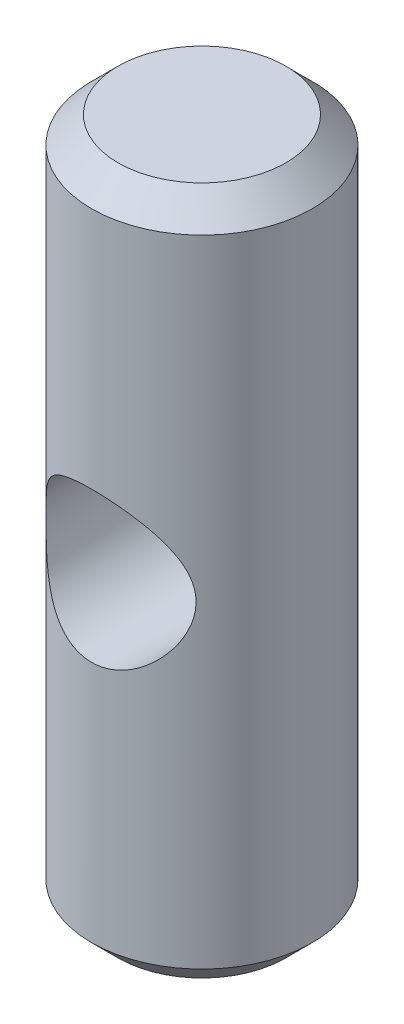
ISO-10303-21;
HEADER;
FILE_DESCRIPTION(('STEP AP214'),'2;1');
FILE_NAME('part.step','',(''),(''),'','','');
FILE_SCHEMA(('AUTOMOTIVE_DESIGN { 1 0 10303 214 1 1 1 1 }'));
ENDSEC;
DATA;
#1=APPLICATION_CONTEXT('core data for automotive mechanical design processes');
#2=APPLICATION_PROTOCOL_DEFINITION('international standard','automotive_design',2000,#1);
#3=PRODUCT_CONTEXT('',#1,'mechanical');
#4=PRODUCT('Part','Part','',(#3));
#5=PRODUCT_RELATED_PRODUCT_CATEGORY('part','',(#4));
#6=PRODUCT_DEFINITION_FORMATION('','',#4);
#7=PRODUCT_DEFINITION_CONTEXT('part definition',#1,'design');
#8=PRODUCT_DEFINITION('design','',#6,#7);
#9=PRODUCT_DEFINITION_SHAPE('','',#8);
#10=(LENGTH_UNIT() NAMED_UNIT(*) SI_UNIT(.MILLI.,.METRE.));
#11=(NAMED_UNIT(*) PLANE_ANGLE_UNIT() SI_UNIT($,.RADIAN.));
#12=(NAMED_UNIT(*) SI_UNIT($,.STERADIAN.) SOLID_ANGLE_UNIT());
#13=UNCERTAINTY_MEASURE_WITH_UNIT(LENGTH_MEASURE(1.E-05),#10,'distance_accuracy_value','');
#14=(GEOMETRIC_REPRESENTATION_CONTEXT(3) GLOBAL_UNCERTAINTY_ASSIGNED_CONTEXT((#13)) GLOBAL_UNIT_ASSIGNED_CONTEXT((#10,
#11,#12)) REPRESENTATION_CONTEXT('',''));
#15=CARTESIAN_POINT('',(0.,0.,0.));
#16=DIRECTION('',(0.,0.,1.));
#17=DIRECTION('',(1.,0.,0.));
#18=AXIS2_PLACEMENT_3D('',#15,#16,#17);
#19=CARTESIAN_POINT('',(0.,39.,0.));
#20=DIRECTION('',(0.,-1.,0.));
#21=DIRECTION('',(0.,0.,-1.));
#22=AXIS2_PLACEMENT_3D('',#19,#20,#21);
#23=CYLINDRICAL_SURFACE('',#22,12.5);
#24=CARTESIAN_POINT('',(0.,8.49999999999999,-12.5));
#25=CARTESIAN_POINT('',(-0.212611229406531,8.4999991639074,-12.4999992129301));
#26=CARTESIAN_POINT('',(-0.425235324985802,8.49201135696874,-12.4945635526216));
#27=CARTESIAN_POINT('',(-0.848748096912115,8.46018514502909,-12.4729546709161));
#28=CARTESIAN_POINT('',(-1.05963663672391,8.43634550481497,-12.4567806127574));
#29=CARTESIAN_POINT('',(-1.47813144874979,8.37316767042175,-12.4140805147799));
#30=CARTESIAN_POINT('',(-1.68573577573117,8.33382062424304,-12.3875485625085));
#31=CARTESIAN_POINT('',(-2.09603319242797,8.24020192526075,-12.3247605864052));
#32=CARTESIAN_POINT('',(-2.29872630768199,8.18593035008375,-12.2885046131505));
#33=CARTESIAN_POINT('',(-2.69687782059281,8.06349857846303,-12.2072897287299));
#34=CARTESIAN_POINT('',(-2.89236813271905,7.99541143656719,-12.1623766550361));
#35=CARTESIAN_POINT('',(-3.27622640483553,7.84594082403003,-12.0646421761312));
#36=CARTESIAN_POINT('',(-3.46459154778753,7.76455216072527,-12.0118176831271));
#37=CARTESIAN_POINT('',(-3.8332134193854,7.58934124360817,-11.8993103261073));
#38=CARTESIAN_POINT('',(-4.01347330451248,7.49552388714581,-11.8396301646949));
#39=CARTESIAN_POINT('',(-4.36534472829234,7.29621057492001,-11.7144651992292));
#40=CARTESIAN_POINT('',(-4.53695302658433,7.19071029003901,-11.6489782452681));
#41=CARTESIAN_POINT('',(-5.06667233733581,6.83873972145517,-11.4338002865402));
#42=CARTESIAN_POINT('',(-5.40791044131654,6.57183587234883,-11.275289082089));
#43=CARTESIAN_POINT('',(-6.04383553620059,5.99230020090767,-10.9476160988973));
#44=CARTESIAN_POINT('',(-6.33845313238221,5.67960152048925,-10.7784389576852));
#45=CARTESIAN_POINT('',(-6.76524031079195,5.15207751469636,-10.5126540168838));
#46=CARTESIAN_POINT('',(-6.91391766961813,4.95081833390408,-10.4152047270699));
#47=CARTESIAN_POINT('',(-7.19372836011809,4.53466127983462,-10.2239406887833));
#48=CARTESIAN_POINT('',(-7.32485747873144,4.31976014953013,-10.1301268169452));
#49=CARTESIAN_POINT('',(-7.56837784801758,3.87728453965254,-9.94950319761834));
#50=CARTESIAN_POINT('',(-7.68079896595188,3.64973104981911,-9.86268240232268));
#51=CARTESIAN_POINT('',(-7.88596866332237,3.1822339365503,-9.69941732082144));
#52=CARTESIAN_POINT('',(-7.9787168962926,2.94229009499671,-9.62297321737187));
#53=CARTESIAN_POINT('',(-8.11849832325081,2.52448279835233,-9.50503456510722));
#54=CARTESIAN_POINT('',(-8.17091788226447,2.34942992045085,-9.45991392681686));
#55=CARTESIAN_POINT('',(-8.26470838093257,1.99455320219839,-9.37808462233733));
#56=CARTESIAN_POINT('',(-8.30608643424036,1.81473251608633,-9.34137054227338));
#57=CARTESIAN_POINT('',(-8.37721986170619,1.45134940351045,-9.27763294927379));
#58=CARTESIAN_POINT('',(-8.40699037275047,1.2677921807992,-9.25059681954442));
#59=CARTESIAN_POINT('',(-8.45450274260778,0.897860127591443,-9.20719421658495));
#60=CARTESIAN_POINT('',(-8.47224456881083,0.711485289457738,-9.19082777228057));
#61=CARTESIAN_POINT('',(-8.49542774911735,0.336415887727055,-9.16940360323845));
#62=CARTESIAN_POINT('',(-8.50080981047673,0.147714490288333,-9.16440039189994));
#63=CARTESIAN_POINT('',(-8.49899309832958,-0.229574503370293,-9.16608517417559));
#64=CARTESIAN_POINT('',(-8.49179431975343,-0.418162099544308,-9.17277317250089));
#65=CARTESIAN_POINT('',(-8.46494901569467,-0.793801379472189,-9.19755223152106));
#66=CARTESIAN_POINT('',(-8.44529473460823,-0.980852032664895,-9.21565039688984));
#67=CARTESIAN_POINT('',(-8.39389136284029,-1.35191704636093,-9.26249376281584));
#68=CARTESIAN_POINT('',(-8.36214199588655,-1.53593133740844,-9.29123920657452));
#69=CARTESIAN_POINT('',(-8.28904286578344,-1.89016540200363,-9.35649660943276));
#70=CARTESIAN_POINT('',(-8.24828955620088,-2.0606000697388,-9.39251749110933));
#71=CARTESIAN_POINT('',(-8.15687607698334,-2.39703838226241,-9.47201379261137));
#72=CARTESIAN_POINT('',(-8.10621222038423,-2.56304035177822,-9.51549198599409));
#73=CARTESIAN_POINT('',(-7.94004717374604,-3.05365736865764,-9.65539110262551));
#74=CARTESIAN_POINT('',(-7.81036608355044,-3.37091404825555,-9.76128254981763));
#75=CARTESIAN_POINT('',(-7.55436370233591,-3.90455677210815,-9.95995741389656));
#76=CARTESIAN_POINT('',(-7.43561726211519,-4.126036099171,-10.0491983821259));
#77=CARTESIAN_POINT('',(-7.18015660851209,-4.55608081630595,-10.2332855426676));
#78=CARTESIAN_POINT('',(-7.04343574552228,-4.7646413848901,-10.3281338022064));
#79=CARTESIAN_POINT('',(-6.75265789244993,-5.16852530921718,-10.5205544166205));
#80=CARTESIAN_POINT('',(-6.59857255721545,-5.36382616273832,-10.6181310241277));
#81=CARTESIAN_POINT('',(-6.2738886822198,-5.74021551780521,-10.8131484907169));
#82=CARTESIAN_POINT('',(-6.10329207879085,-5.9213056813871,-10.9105893643605));
#83=CARTESIAN_POINT('',(-5.744544303175,-6.27003459745641,-11.1036963668884));
#84=CARTESIAN_POINT('',(-5.55625225597372,-6.43754140433822,-11.1993394266261));
#85=CARTESIAN_POINT('',(-5.16396350310388,-6.7562819261896,-11.3855443251041));
#86=CARTESIAN_POINT('',(-4.95996542345107,-6.90751421466188,-11.4761057180928));
#87=CARTESIAN_POINT('',(-4.53740472159614,-7.19212977307888,-11.6496366590009));
#88=CARTESIAN_POINT('',(-4.31886875033325,-7.32554442533666,-11.7326194713579));
#89=CARTESIAN_POINT('',(-3.86797195499051,-7.57330248620781,-11.8888885095943));
#90=CARTESIAN_POINT('',(-3.63561531819139,-7.6876516316151,-11.9621776509134));
#91=CARTESIAN_POINT('',(-3.21144130470796,-7.87259042083719,-12.0819654469364));
#92=CARTESIAN_POINT('',(-3.02205326651099,-7.94726158835923,-12.1308016584786));
#93=CARTESIAN_POINT('',(-2.63670087538949,-8.08328742186423,-12.2203482439586));
#94=CARTESIAN_POINT('',(-2.4407378203019,-8.14464469821701,-12.2610602106394));
#95=CARTESIAN_POINT('',(-2.04341856904867,-8.25329241278791,-12.3334989745208));
#96=CARTESIAN_POINT('',(-1.84206499338533,-8.30058955542913,-12.3652300538139));
#97=CARTESIAN_POINT('',(-1.43518188941921,-8.38052709990867,-12.4190321476114));
#98=CARTESIAN_POINT('',(-1.22965226709327,-8.41316717136181,-12.441102944363));
#99=CARTESIAN_POINT('',(-0.815207190454649,-8.4634009123826,-12.4751277150926));
#100=CARTESIAN_POINT('',(-0.60628256749737,-8.48094279501704,-12.4870468673847));
#101=CARTESIAN_POINT('',(-0.187370529507895,-8.50052106301419,-12.5003522522041));
#102=CARTESIAN_POINT('',(0.022616884653477,-8.50255746107965,-12.5017384933603));
#103=CARTESIAN_POINT('',(0.441977632879455,-8.4910928806054,-12.4939441725854));
#104=CARTESIAN_POINT('',(0.651350937217907,-8.47759116198791,-12.4847631073353));
#105=CARTESIAN_POINT('',(1.06781626073919,-8.43525792222967,-12.4560561283182));
#106=CARTESIAN_POINT('',(1.27490833558745,-8.40642677599957,-12.4365304675482));
#107=CARTESIAN_POINT('',(1.67428781800204,-8.33580620011295,-12.3889073455685));
#108=CARTESIAN_POINT('',(1.86677484519458,-8.29479186339277,-12.3613238997183));
#109=CARTESIAN_POINT('',(2.24721772650369,-8.19990622798388,-12.2978542116027));
#110=CARTESIAN_POINT('',(2.43517201084202,-8.14603054360643,-12.2619651372658));
#111=CARTESIAN_POINT('',(2.80541670195474,-8.02605126266958,-12.1825890609117));
#112=CARTESIAN_POINT('',(2.98770864248847,-7.95995101171516,-12.1391041378977));
#113=CARTESIAN_POINT('',(3.34590416619502,-7.81614954581967,-12.0452988690557));
#114=CARTESIAN_POINT('',(3.52180537622699,-7.73844407503488,-11.9949760162484));
#115=CARTESIAN_POINT('',(3.88031205030355,-7.56544076962023,-11.8840705305856));
#116=CARTESIAN_POINT('',(4.06232426080534,-7.46923194395762,-11.822988789701));
#117=CARTESIAN_POINT('',(4.4174003575195,-7.26488731836293,-11.6949675512413));
#118=CARTESIAN_POINT('',(4.59046042536939,-7.15674648968412,-11.6280255863472));
#119=CARTESIAN_POINT('',(5.09553911437629,-6.81546087342392,-11.4200600711919));
#120=CARTESIAN_POINT('',(5.41350998148694,-6.56542673887321,-11.2718797237288));
#121=CARTESIAN_POINT('',(5.88447632341429,-6.1382424608712,-11.0300157872951));
#122=CARTESIAN_POINT('',(6.05109822364662,-5.97401067710243,-10.9392888561071));
#123=CARTESIAN_POINT('',(6.36999669503495,-5.63272878923321,-10.7567107993367));
#124=CARTESIAN_POINT('',(6.52227604622003,-5.45568118105036,-10.6648598955309));
#125=CARTESIAN_POINT('',(6.81208921698918,-5.08920872094441,-10.4821186841034));
#126=CARTESIAN_POINT('',(6.94961342696887,-4.899775930587,-10.3912290368342));
#127=CARTESIAN_POINT('',(7.2091725737248,-4.50919739117484,-10.212867133094));
#128=CARTESIAN_POINT('',(7.3312099997648,-4.30805353209675,-10.1253943289862));
#129=CARTESIAN_POINT('',(7.6413117174783,-3.74504307831773,-9.89544194142684));
#130=CARTESIAN_POINT('',(7.81365560029483,-3.37172386163585,-9.75870050072534));
#131=CARTESIAN_POINT('',(8.03185839695517,-2.78965723987431,-9.57852897801291));
#132=CARTESIAN_POINT('',(8.09785246373813,-2.5920508777165,-9.5226488006139));
#133=CARTESIAN_POINT('',(8.21569108391976,-2.19002993966036,-9.42117069089607));
#134=CARTESIAN_POINT('',(8.26753853402295,-1.98561676717839,-9.375570653917));
#135=CARTESIAN_POINT('',(8.34891457244464,-1.60530111272045,-9.30312255176955));
#136=CARTESIAN_POINT('',(8.38071060614132,-1.43023273327683,-9.27442445038085));
#137=CARTESIAN_POINT('',(8.43335759447561,-1.07717839228992,-9.22657851080833));
#138=CARTESIAN_POINT('',(8.45421074489629,-0.899193023462812,-9.20742875670543));
#139=CARTESIAN_POINT('',(8.48462590513333,-0.541575160788118,-9.17940927863587));
#140=CARTESIAN_POINT('',(8.49419587547128,-0.361943918418958,-9.17053230708616));
#141=CARTESIAN_POINT('',(8.50190326230583,-0.00221826905570866,-9.1633874625019));
#142=CARTESIAN_POINT('',(8.50004044888092,0.177876147180333,-9.16511980282826));
#143=CARTESIAN_POINT('',(8.48491973775006,0.537055645604595,-9.17911982332172));
#144=CARTESIAN_POINT('',(8.47166896204319,0.716141288232058,-9.19138091883147));
#145=CARTESIAN_POINT('',(8.43401190841614,1.07214121355693,-9.2259466375048));
#146=CARTESIAN_POINT('',(8.40960570874408,1.24905551147598,-9.24825119021997));
#147=CARTESIAN_POINT('',(8.34999087744399,1.5997902732501,-9.30211059217691));
#148=CARTESIAN_POINT('',(8.31477174417639,1.77360755484554,-9.33367443280799));
#149=CARTESIAN_POINT('',(8.23399688640742,2.11718373164181,-9.4050090004596));
#150=CARTESIAN_POINT('',(8.18843529403794,2.28694026227548,-9.44478438519404));
#151=CARTESIAN_POINT('',(8.07133858065295,2.67520382969941,-9.54521836203062));
#152=CARTESIAN_POINT('',(7.99615670437936,2.89194177930875,-9.60848763482576));
#153=CARTESIAN_POINT('',(7.82977778562174,3.31610119313206,-9.74454307136206));
#154=CARTESIAN_POINT('',(7.73857476504883,3.52351914329787,-9.81733278493736));
#155=CARTESIAN_POINT('',(7.54100901203986,3.92861609861968,-9.96989338780853));
#156=CARTESIAN_POINT('',(7.43462915211643,4.12628375644267,-10.0496721246119));
#157=CARTESIAN_POINT('',(7.20756400400657,4.5112031222072,-10.2137476160052));
#158=CARTESIAN_POINT('',(7.08687969143419,4.69845553922644,-10.2980440622568));
#159=CARTESIAN_POINT('',(6.82924274151675,5.06584454227428,-10.4707196427112));
#160=CARTESIAN_POINT('',(6.69201335046604,5.24576434327886,-10.5591466909608));
#161=CARTESIAN_POINT('',(6.40372122532588,5.59405742314174,-10.7364335060975));
#162=CARTESIAN_POINT('',(6.25265324016938,5.76242627624611,-10.8252934250271));
#163=CARTESIAN_POINT('',(5.93711876139708,6.0870234387961,-11.0015125380574));
#164=CARTESIAN_POINT('',(5.7726502369996,6.24324990109033,-11.0888715022582));
#165=CARTESIAN_POINT('',(5.43075906662421,6.54282142578617,-11.2602586816036));
#166=CARTESIAN_POINT('',(5.25333683727211,6.68616690214425,-11.3442870037365));
#167=CARTESIAN_POINT('',(4.86280344788979,6.97635617744865,-11.5175664782057));
#168=CARTESIAN_POINT('',(4.64801393352488,7.12135889779644,-11.6061386832676));
#169=CARTESIAN_POINT('',(4.20346535730457,7.39247293121864,-11.7744368948175));
#170=CARTESIAN_POINT('',(3.97370392709398,7.51858124499235,-11.854161496316));
#171=CARTESIAN_POINT('',(3.50095025371574,7.74999907866129,-12.0022746388593));
#172=CARTESIAN_POINT('',(3.25798165837109,7.85534430590749,-12.0706826085548));
#173=CARTESIAN_POINT('',(2.76031494250426,8.0437156063356,-12.1941088824536));
#174=CARTESIAN_POINT('',(2.50562230406707,8.12675198927162,-12.249133370549));
#175=CARTESIAN_POINT('',(2.06534954894274,8.24739792519654,-12.329567052311));
#176=CARTESIAN_POINT('',(1.882142055752,8.29115225681941,-12.3589009427645));
#177=CARTESIAN_POINT('',(1.51217598659134,8.36653680966856,-12.4095993153829));
#178=CARTESIAN_POINT('',(1.32541809579891,8.39816934579647,-12.4309653191557));
#179=CARTESIAN_POINT('',(0.949520469364734,8.44892697758819,-12.4653126060539));
#180=CARTESIAN_POINT('',(0.760381715142823,8.46805706525246,-12.4782972356842));
#181=CARTESIAN_POINT('',(0.380832179850998,8.49359470711208,-12.495641797779));
#182=CARTESIAN_POINT('',(0.190421250259467,8.5000007488306,-12.5000007049244));
#183=CARTESIAN_POINT('',(0.,8.49999999999999,-12.5));
#184=B_SPLINE_CURVE_WITH_KNOTS('',3,(#24,#25,#26,#27,#28,#29,#30,#31,#32,#33,#34,#35,#36,#37,
#38,#39,#40,#41,#42,#43,#44,#45,#46,#47,#48,#49,#50,#51,#52,#53,#54,#55,#56,#57,#58,#59,#60,#61,
#62,#63,#64,#65,#66,#67,#68,#69,#70,#71,#72,#73,#74,#75,#76,#77,#78,#79,#80,#81,#82,#83,#84,#85,
#86,#87,#88,#89,#90,#91,#92,#93,#94,#95,#96,#97,#98,#99,#100,#101,#102,#103,#104,#105,#106,#107,
#108,#109,#110,#111,#112,#113,#114,#115,#116,#117,#118,#119,#120,#121,#122,#123,#124,#125,#126,
#127,#128,#129,#130,#131,#132,#133,#134,#135,#136,#137,#138,#139,#140,#141,#142,#143,#144,#145,
#146,#147,#148,#149,#150,#151,#152,#153,#154,#155,#156,#157,#158,#159,#160,#161,#162,#163,#164,
#165,#166,#167,#168,#169,#170,#171,#172,#173,#174,#175,#176,#177,#178,#179,#180,#181,#182,#183),
.UNSPECIFIED.,.T.,.F.,(4,2,2,2,2,2,2,2,2,2,2,2,2,2,2,2,2,2,2,2,2,2,2,2,2,2,2,2,2,2,2,2,2,2,2,2,
2,2,2,2,2,2,2,2,2,2,2,2,2,2,2,2,2,2,2,2,2,2,2,2,2,2,2,2,2,2,2,2,2,2,2,2,2,2,2,2,2,2,2,4),(0.,
0.637638569316182,1.27532683079305,1.91337962848085,2.55142910754345,3.18618871327802,
3.82119671172003,4.45595523440742,5.09094975939608,6.46937914241849,7.84984140223582,
8.65461300195751,9.45957746955406,10.2632442217744,11.0669251264715,11.6310837059482,
12.1948779355317,12.7579344669572,13.3209925248329,13.8867461142772,14.4524999316997,
15.0186063707375,15.5847257413799,16.1209085432474,16.6572911988077,17.729962068664,
18.5291174726279,19.3285693591328,20.129345680615,20.9300282058792,21.7377350551794,
22.5455126441933,23.3518481787031,24.1579406479864,24.7853694223414,25.4126750693585,
26.0396811108585,26.6667012849985,27.2958636699022,27.9250255393692,28.554217376946,
29.1833938271328,29.7789366809116,30.3746829041908,30.9702663249758,31.566068695707,
32.2096414263224,32.8534864344468,34.1409914628099,34.893197555009,35.6452575450771,
36.3978043947685,37.1502301304352,38.4443718771902,39.0908409976289,39.7371776455615,
40.2773148354423,40.8173436006944,41.3569911358348,41.8966495237113,42.4359706561683,
42.9752880056927,43.5151308120085,44.0552806709294,44.7681537714426,45.4812934388263,
46.1952443656952,46.909146626585,47.6373057820495,48.3657423918077,49.0942895983837,
49.8228133832457,50.6432675911966,51.463851900488,52.2830124533646,53.1017937876741,
53.673152307973,54.2444016613844,54.8154227857347,55.3865117819358),.UNSPECIFIED.);
#185=CARTESIAN_POINT('',(0.,8.49999999999999,-12.5));
#186=VERTEX_POINT('',#185);
#187=EDGE_CURVE('E43',#186,#186,#184,.T.);
#188=ORIENTED_EDGE('',*,*,#187,.T.);
#189=EDGE_LOOP('',(#188));
#190=FACE_BOUND('',#189,.T.);
#191=CARTESIAN_POINT('',(8.50000000000005,0.,9.16515138991168));
#192=CARTESIAN_POINT('',(8.49999848103357,-0.206088728048728,9.16515435137744));
#193=CARTESIAN_POINT('',(8.49248800048588,-0.412212060655086,9.17213583057472));
#194=CARTESIAN_POINT('',(8.46261532781037,-0.822482695778911,9.19970325006821));
#195=CARTESIAN_POINT('',(8.44024911507193,-1.02662944816777,9.22029287331569));
#196=CARTESIAN_POINT('',(8.38110344428739,-1.43143853036619,9.2740873013755));
#197=CARTESIAN_POINT('',(8.3443018628379,-1.63209501573091,9.30731146727961));
#198=CARTESIAN_POINT('',(8.25695470058672,-2.02827116070187,9.3848869197149));
#199=CARTESIAN_POINT('',(8.20640187372766,-2.22378805232511,9.42924407168694));
#200=CARTESIAN_POINT('',(8.09292937857942,-2.60651269076976,9.52680514030859));
#201=CARTESIAN_POINT('',(8.0301470384164,-2.79378671925094,9.57990988979939));
#202=CARTESIAN_POINT('',(7.89263199756949,-3.16147211352697,9.69352020888648));
#203=CARTESIAN_POINT('',(7.81790087738241,-3.34188438304345,9.75402479943771));
#204=CARTESIAN_POINT('',(7.5766884397089,-3.87228632386062,9.94412008782077));
#205=CARTESIAN_POINT('',(7.39312795371836,-4.21164033238044,10.0823463734539));
#206=CARTESIAN_POINT('',(7.07025089931892,-4.72346898058288,10.3093525360843));
#207=CARTESIAN_POINT('',(6.94452130536774,-4.90639680333774,10.3946444109643));
#208=CARTESIAN_POINT('',(6.67951741016979,-5.26147264248069,10.5668815131737));
#209=CARTESIAN_POINT('',(6.54024093789125,-5.43361892372064,10.6538270037107));
#210=CARTESIAN_POINT('',(6.24847211705665,-5.76677475148639,10.8275327870459));
#211=CARTESIAN_POINT('',(6.09596586520742,-5.92777225428573,10.9142927843839));
#212=CARTESIAN_POINT('',(5.77824797680767,-6.23787798047958,11.0857764344671));
#213=CARTESIAN_POINT('',(5.61303651934252,-6.38698637139595,11.1705001158931));
#214=CARTESIAN_POINT('',(5.24396777814779,-6.69455134158238,11.3489649684113));
#215=CARTESIAN_POINT('',(5.03807127007634,-6.85092906699647,11.4420938236212));
#216=CARTESIAN_POINT('',(4.61060952227589,-7.14560475266038,11.6209276386171));
#217=CARTESIAN_POINT('',(4.38904162928077,-7.28389964002449,11.7066313357849));
#218=CARTESIAN_POINT('',(3.93167037859809,-7.54059872775554,11.86805321834));
#219=CARTESIAN_POINT('',(3.695889152668,-7.65903281886523,11.9437863719154));
#220=CARTESIAN_POINT('',(3.21133572211429,-7.87448721302272,12.0830786875566));
#221=CARTESIAN_POINT('',(2.9625687953924,-7.97151613345684,12.1466427473417));
#222=CARTESIAN_POINT('',(2.5194083510416,-8.12048949225862,12.2450026092391));
#223=CARTESIAN_POINT('',(2.32744758813448,-8.17761353995429,12.2829947849229));
#224=CARTESIAN_POINT('',(1.93855933051285,-8.27842440905486,12.3503400478085));
#225=CARTESIAN_POINT('',(1.74163284484193,-8.32211393694642,12.3796948750187));
#226=CARTESIAN_POINT('',(1.34415899673731,-8.3954782559937,12.4291319561483));
#227=CARTESIAN_POINT('',(1.14361390688545,-8.42516154578202,12.4492198328542));
#228=CARTESIAN_POINT('',(0.740172438537721,-8.47014398577308,12.4797061168245));
#229=CARTESIAN_POINT('',(0.537275982330216,-8.48544265919027,12.4901042029156));
#230=CARTESIAN_POINT('',(0.130292677784343,-8.5014449957978,12.5009812517458));
#231=CARTESIAN_POINT('',(-0.0737956130943147,-8.50212364913509,12.5014432171794));
#232=CARTESIAN_POINT('',(-0.481268456170092,-8.48881228385605,12.4923941008278));
#233=CARTESIAN_POINT('',(-0.684653010975125,-8.47482231965741,12.4828830560406));
#234=CARTESIAN_POINT('',(-1.08925251926921,-8.43237316575785,12.4541027119486));
#235=CARTESIAN_POINT('',(-1.290466933798,-8.40391046253482,12.4348310430782));
#236=CARTESIAN_POINT('',(-1.6892604092624,-8.33291196470859,12.3869582752026));
#237=CARTESIAN_POINT('',(-1.88683945822211,-8.29037612375329,12.3583571454694));
#238=CARTESIAN_POINT('',(-2.273411257514,-8.19271606831162,12.2930591969054));
#239=CARTESIAN_POINT('',(-2.46249567210529,-8.13784446889487,12.2565252803728));
#240=CARTESIAN_POINT('',(-2.83498515320645,-8.01569065240002,12.1757627196494));
#241=CARTESIAN_POINT('',(-3.01838819594673,-7.94840407100622,12.1315313698437));
#242=CARTESIAN_POINT('',(-3.37855314009493,-7.80212422338482,12.0361979722602));
#243=CARTESIAN_POINT('',(-3.55531685315279,-7.72313418015831,11.9850978164322));
#244=CARTESIAN_POINT('',(-3.90160552151592,-7.55411389413236,11.8768867769885));
#245=CARTESIAN_POINT('',(-4.07112783111469,-7.46407966198258,11.8197737224727));
#246=CARTESIAN_POINT('',(-4.60515263764886,-7.15702515533225,11.6273640591456));
#247=CARTESIAN_POINT('',(-4.95443467378749,-6.91941946360898,11.4819087248686));
#248=CARTESIAN_POINT('',(-5.61048966004963,-6.39907800227539,11.1760341307865));
#249=CARTESIAN_POINT('',(-5.91721289759737,-6.11629027143204,11.0155977314986));
#250=CARTESIAN_POINT('',(-6.36728205780269,-5.63619465118879,10.7584574722756));
#251=CARTESIAN_POINT('',(-6.5256230542975,-5.45208481303526,10.6629213780352));
#252=CARTESIAN_POINT('',(-6.82630605473485,-5.07055692129289,10.4729720040763));
#253=CARTESIAN_POINT('',(-6.96864485838237,-4.87313621823489,10.3785589523203));
#254=CARTESIAN_POINT('',(-7.23654495126265,-4.46563149875465,10.1935722563914));
#255=CARTESIAN_POINT('',(-7.36211199511761,-4.255551861875,10.1029973026346));
#256=CARTESIAN_POINT('',(-7.59563797334544,-3.82316808017903,9.92862060231437));
#257=CARTESIAN_POINT('',(-7.70360245559496,-3.6008678166432,9.84481672589768));
#258=CARTESIAN_POINT('',(-7.87744955410163,-3.19871149281723,9.70593012274128));
#259=CARTESIAN_POINT('',(-7.94724371410613,-3.02126590529239,9.64874475825135));
#260=CARTESIAN_POINT('',(-8.07530611883444,-2.66009809103177,9.54182315551203));
#261=CARTESIAN_POINT('',(-8.13357730307946,-2.47637747912103,9.49208501825665));
#262=CARTESIAN_POINT('',(-8.23787325719612,-2.10353590742443,9.40171308048352));
#263=CARTESIAN_POINT('',(-8.28391305254534,-1.91442189246219,9.36106811936884));
#264=CARTESIAN_POINT('',(-8.36314474689063,-1.53165800275526,9.29035184375984));
#265=CARTESIAN_POINT('',(-8.39634341794785,-1.33801057611308,9.26027495671818));
#266=CARTESIAN_POINT('',(-8.44956721836599,-0.945692041994145,9.21173887830028));
#267=CARTESIAN_POINT('',(-8.46947419807785,-0.746991763222335,9.19338394417147));
#268=CARTESIAN_POINT('',(-8.49523044262476,-0.34790387293814,9.16958957563399));
#269=CARTESIAN_POINT('',(-8.50107999980425,-0.147516296602525,9.1641498726344));
#270=CARTESIAN_POINT('',(-8.49859215529454,0.253093847137856,9.16645695363142));
#271=CARTESIAN_POINT('',(-8.49025465520226,0.453316413388456,9.17420382909165));
#272=CARTESIAN_POINT('',(-8.45957672496459,0.851756835090849,9.20249925457852));
#273=CARTESIAN_POINT('',(-8.43723660531875,1.04997473489587,9.22304752074206));
#274=CARTESIAN_POINT('',(-8.38234977035323,1.42025394380986,9.27293958236994));
#275=CARTESIAN_POINT('',(-8.35126652077467,1.59270907583352,9.30100519977011));
#276=CARTESIAN_POINT('',(-8.27891598055431,1.93390828312783,9.36546286410256));
#277=CARTESIAN_POINT('',(-8.23764498671889,2.10265098460297,9.40185793839908));
#278=CARTESIAN_POINT('',(-8.09920438866342,2.60235745564953,9.52196552448907));
#279=CARTESIAN_POINT('',(-7.98740749031453,2.92679747092539,9.61660009122972));
#280=CARTESIAN_POINT('',(-7.76406944710815,3.46846651899264,9.79713340382956));
#281=CARTESIAN_POINT('',(-7.66076855638966,3.69080928687388,9.87837957197693));
#282=CARTESIAN_POINT('',(-7.43668030925492,4.12373086032429,10.0481614663021));
#283=CARTESIAN_POINT('',(-7.31588641170573,4.33430522435023,10.1366999139061));
#284=CARTESIAN_POINT('',(-7.05755511051301,4.74336953550824,10.3182305157256));
#285=CARTESIAN_POINT('',(-6.9199913389539,4.94183969620749,10.4112295405373));
#286=CARTESIAN_POINT('',(-6.6289650617256,5.32586600935381,10.5989056436404));
#287=CARTESIAN_POINT('',(-6.47550429941205,5.51142357414732,10.6935825369852));
#288=CARTESIAN_POINT('',(-6.15090881561908,5.87162099499198,10.8835743426256));
#289=CARTESIAN_POINT('',(-5.97955300749704,6.04606711246697,10.9788790600963));
#290=CARTESIAN_POINT('',(-5.62152225032707,6.38031823732258,11.1664376651947));
#291=CARTESIAN_POINT('',(-5.4348461707565,6.54012216237286,11.2586913269709));
#292=CARTESIAN_POINT('',(-5.04701734410803,6.84384351968125,11.4377960077872));
#293=CARTESIAN_POINT('',(-4.84588487373397,6.98778251264816,11.5246542873473));
#294=CARTESIAN_POINT('',(-4.42966325122995,7.25876819250256,11.6909483753739));
#295=CARTESIAN_POINT('',(-4.21457708638763,7.38581847738029,11.7703857637206));
#296=CARTESIAN_POINT('',(-3.81036768146119,7.60091562227886,11.9066482210212));
#297=CARTESIAN_POINT('',(-3.6233131569927,7.69189434623213,11.9649950072684));
#298=CARTESIAN_POINT('',(-3.2411837955244,7.8605550298275,12.0741123304867));
#299=CARTESIAN_POINT('',(-3.04611042740104,7.93823941135963,12.1248842471893));
#300=CARTESIAN_POINT('',(-2.64898456574904,8.07943498400339,12.2177921267493));
#301=CARTESIAN_POINT('',(-2.44693506262304,8.14295216304682,12.2599317375339));
#302=CARTESIAN_POINT('',(-2.03698952979332,8.25504833242399,12.3346697076918));
#303=CARTESIAN_POINT('',(-1.82909342825779,8.30362713913604,12.3672679497829));
#304=CARTESIAN_POINT('',(-1.40786635197285,8.38535402954421,12.4222881658997));
#305=CARTESIAN_POINT('',(-1.19451359000303,8.41842464178954,12.444659035257));
#306=CARTESIAN_POINT('',(-0.76504238735725,8.46826065674087,12.4784254522543));
#307=CARTESIAN_POINT('',(-0.548923940486844,8.48502602292071,12.4898209753078));
#308=CARTESIAN_POINT('',(-0.115773629314032,8.50197421680753,12.5013410054429));
#309=CARTESIAN_POINT('',(0.10125807148217,8.50215989629497,12.5014674508564));
#310=CARTESIAN_POINT('',(0.534404324530549,8.48595163262074,12.4904499089418));
#311=CARTESIAN_POINT('',(0.750518927113438,8.46955861143731,12.4793065483525));
#312=CARTESIAN_POINT('',(1.16241743812839,8.42248049955038,12.4474056750359));
#313=CARTESIAN_POINT('',(1.35841686789459,8.39307583105215,12.4275102687628));
#314=CARTESIAN_POINT('',(1.74688971829361,8.32090248080877,12.3788814682301));
#315=CARTESIAN_POINT('',(1.93936192547822,8.27812928806602,12.3501450907756));
#316=CARTESIAN_POINT('',(2.31949660045238,8.17976012888761,12.2844266338982));
#317=CARTESIAN_POINT('',(2.50716024813587,8.12416734217822,12.2474465992782));
#318=CARTESIAN_POINT('',(2.87680266763824,8.00074950507984,12.1659297205088));
#319=CARTESIAN_POINT('',(3.05877922007526,7.93291974747031,12.1213899687392));
#320=CARTESIAN_POINT('',(3.42502338753252,7.78205387199987,12.0231826731012));
#321=CARTESIAN_POINT('',(3.60895648656007,7.69843014276207,11.9691718279184));
#322=CARTESIAN_POINT('',(3.96887157093936,7.51920837118768,11.8546927188142));
#323=CARTESIAN_POINT('',(4.14485064361241,7.42360598997062,11.7942221162301));
#324=CARTESIAN_POINT('',(4.48818758741187,7.22121052996684,11.6678888493749));
#325=CARTESIAN_POINT('',(4.65554628513361,7.1144185271276,11.6020267036652));
#326=CARTESIAN_POINT('',(4.98122598477098,6.89031710836144,11.4659732144009));
#327=CARTESIAN_POINT('',(5.13954593071526,6.77300646767085,11.3957813670045));
#328=CARTESIAN_POINT('',(5.47100763974773,6.50920384126849,11.2408452514058));
#329=CARTESIAN_POINT('',(5.64255328442265,6.36102654779211,11.155550870367));
#330=CARTESIAN_POINT('',(5.97261424917885,6.05218750694919,10.9823777402566));
#331=CARTESIAN_POINT('',(6.13112820936111,5.89152446004776,10.8944987227656));
#332=CARTESIAN_POINT('',(6.4350691214634,5.55795958578319,10.717782156074));
#333=CARTESIAN_POINT('',(6.58046470142581,5.38503009876807,10.6289428498397));
#334=CARTESIAN_POINT('',(6.85726418389391,5.02781977083318,10.4525049753565));
#335=CARTESIAN_POINT('',(6.98867228429588,4.84354236198784,10.3649060417307));
#336=CARTESIAN_POINT('',(7.25348598690177,4.438797388845,10.1816587502149));
#337=CARTESIAN_POINT('',(7.38484786897897,4.21677037158985,10.086482378698));
#338=CARTESIAN_POINT('',(7.62800421325965,3.75908521680872,9.90387210550151));
#339=CARTESIAN_POINT('',(7.73979297035631,3.52342313152184,9.81644046488625));
#340=CARTESIAN_POINT('',(7.94202112916636,3.04016642034811,9.65355456916812));
#341=CARTESIAN_POINT('',(8.03253732346735,2.79261872514166,9.57805756441742));
#342=CARTESIAN_POINT('',(8.19100322537332,2.28642961869638,9.44289751453995));
#343=CARTESIAN_POINT('',(8.25897325314607,2.02779843540385,9.38322022139061));
#344=CARTESIAN_POINT('',(8.3756543068836,1.47786933164726,9.27928856466895));
#345=CARTESIAN_POINT('',(8.42210570039204,1.18571576706154,9.23688551839359));
#346=CARTESIAN_POINT('',(8.46874460583983,0.743269543733665,9.19406014455721));
#347=CARTESIAN_POINT('',(8.48045122910268,0.595069265834117,9.18324817593681));
#348=CARTESIAN_POINT('',(8.49607882508032,0.297918599201153,9.16879332688933));
#349=CARTESIAN_POINT('',(8.50000109796361,0.148968339899342,9.16514924925779));
#350=CARTESIAN_POINT('',(8.50000000000005,0.,9.16515138991168));
#351=B_SPLINE_CURVE_WITH_KNOTS('',3,(#191,#192,#193,#194,#195,#196,#197,#198,#199,#200,#201,
#202,#203,#204,#205,#206,#207,#208,#209,#210,#211,#212,#213,#214,#215,#216,#217,#218,#219,#220,
#221,#222,#223,#224,#225,#226,#227,#228,#229,#230,#231,#232,#233,#234,#235,#236,#237,#238,#239,
#240,#241,#242,#243,#244,#245,#246,#247,#248,#249,#250,#251,#252,#253,#254,#255,#256,#257,#258,
#259,#260,#261,#262,#263,#264,#265,#266,#267,#268,#269,#270,#271,#272,#273,#274,#275,#276,#277,
#278,#279,#280,#281,#282,#283,#284,#285,#286,#287,#288,#289,#290,#291,#292,#293,#294,#295,#296,
#297,#298,#299,#300,#301,#302,#303,#304,#305,#306,#307,#308,#309,#310,#311,#312,#313,#314,#315,
#316,#317,#318,#319,#320,#321,#322,#323,#324,#325,#326,#327,#328,#329,#330,#331,#332,#333,#334,
#335,#336,#337,#338,#339,#340,#341,#342,#343,#344,#345,#346,#347,#348,#349,#350),.UNSPECIFIED.,
.T.,.F.,(4,2,2,2,2,2,2,2,2,2,2,2,2,2,2,2,2,2,2,2,2,2,2,2,2,2,2,2,2,2,2,2,2,2,2,2,2,2,2,2,2,2,2,
2,2,2,2,2,2,2,2,2,2,2,2,2,2,2,2,2,2,2,2,2,2,2,2,2,2,2,2,2,2,2,2,2,2,2,2,4),(0.,
0.618076514819941,1.23632037636504,1.85551547358181,2.47503748256097,3.08796676955045,
3.70081504972682,4.92587263263925,5.63876070411436,6.35176321234112,7.06552431523263,
7.7792753591954,8.6025964278707,9.42605722530905,10.2482673598116,11.0701458788781,
11.6810712732916,12.2918735113612,12.9023046519004,13.5127560247828,14.1242515883691,
14.735744883435,15.3473867006088,15.9590305323417,16.5591358153189,17.1594524603584,
17.7596040912054,18.359973149031,19.694926292793,21.03142588795,21.8135552742409,
22.5958408021787,23.3778572238459,24.1596266955043,24.7563236570902,25.3528682038332,
25.9486765093683,26.5441701719308,27.1448890966777,27.7455955284965,28.3463061269018,
28.9470034053871,29.4788453537581,30.0108809094048,31.0749584589159,31.8489288494064,
32.6231894003244,33.3986834449897,34.1740925343603,34.9605742309321,35.747114016307,
36.5325713465696,37.3178610729757,37.9653245056951,38.6126698612417,39.2597410881232,
39.9068202684522,40.5570983861097,41.2073779604824,41.8575456836366,42.5076772515132,
43.1045651992385,43.7016547752325,44.2985964102588,44.8957681635703,45.522577106766,
46.1496137512242,46.7765901576818,47.4036396627282,48.1295072357719,48.8554504595841,
49.5830861114967,50.3105027673523,51.1343321664247,51.9584012941394,52.7794482507792,
53.5997531995793,54.4932533016083,54.9400958609379,55.3868637808303),.UNSPECIFIED.);
#352=CARTESIAN_POINT('',(8.50000000000005,0.,9.16515138991168));
#353=VERTEX_POINT('',#352);
#354=EDGE_CURVE('E52',#353,#353,#351,.T.);
#355=ORIENTED_EDGE('',*,*,#354,.T.);
#356=EDGE_LOOP('',(#355));
#357=FACE_BOUND('',#356,.T.);
#358=CARTESIAN_POINT('',(0.,-36.0000000000001,0.));
#359=DIRECTION('',(0.,1.,0.));
#360=DIRECTION('',(0.,0.,1.));
#361=AXIS2_PLACEMENT_3D('',#358,#359,#360);
#362=CIRCLE('',#361,12.5);
#363=CARTESIAN_POINT('',(0.,-36.0000000000001,12.5));
#364=VERTEX_POINT('',#363);
#365=EDGE_CURVE('E30',#364,#364,#362,.T.);
#366=ORIENTED_EDGE('',*,*,#365,.T.);
#367=EDGE_LOOP('',(#366));
#368=FACE_BOUND('',#367,.T.);
#369=CARTESIAN_POINT('',(0.,36.,0.));
#370=DIRECTION('',(0.,1.,0.));
#371=DIRECTION('',(0.,0.,1.));
#372=AXIS2_PLACEMENT_3D('',#369,#370,#371);
#373=CIRCLE('',#372,12.5);
#374=CARTESIAN_POINT('',(0.,36.,12.5));
#375=VERTEX_POINT('',#374);
#376=EDGE_CURVE('E37',#375,#375,#373,.F.);
#377=ORIENTED_EDGE('',*,*,#376,.T.);
#378=EDGE_LOOP('',(#377));
#379=FACE_BOUND('',#378,.T.);
#380=ADVANCED_FACE('F14',(#190,#357,#368,#379),#23,.T.);
#381=CARTESIAN_POINT('',(0.,39.,0.));
#382=DIRECTION('',(0.,1.,0.));
#383=DIRECTION('',(0.,0.,1.));
#384=AXIS2_PLACEMENT_3D('',#381,#382,#383);
#385=PLANE('',#384);
#386=CARTESIAN_POINT('',(0.,39.,0.));
#387=DIRECTION('',(0.,1.,0.));
#388=DIRECTION('',(0.,0.,1.));
#389=AXIS2_PLACEMENT_3D('',#386,#387,#388);
#390=CIRCLE('',#389,9.50000000000001);
#391=CARTESIAN_POINT('',(0.,39.,9.50000000000001));
#392=VERTEX_POINT('',#391);
#393=EDGE_CURVE('E9',#392,#392,#390,.T.);
#394=ORIENTED_EDGE('',*,*,#393,.T.);
#395=EDGE_LOOP('',(#394));
#396=FACE_BOUND('',#395,.T.);
#397=ADVANCED_FACE('F72',(#396),#385,.T.);
#398=CARTESIAN_POINT('',(0.,-39.0000000000001,0.));
#399=DIRECTION('',(0.,1.,0.));
#400=DIRECTION('',(0.,0.,1.));
#401=AXIS2_PLACEMENT_3D('',#398,#399,#400);
#402=PLANE('',#401);
#403=CARTESIAN_POINT('',(0.,-39.0000000000001,0.));
#404=DIRECTION('',(0.,1.,0.));
#405=DIRECTION('',(0.,0.,1.));
#406=AXIS2_PLACEMENT_3D('',#403,#404,#405);
#407=CIRCLE('',#406,9.49999999999999);
#408=CARTESIAN_POINT('',(0.,-39.0000000000001,9.49999999999999));
#409=VERTEX_POINT('',#408);
#410=EDGE_CURVE('E22',#409,#409,#407,.F.);
#411=ORIENTED_EDGE('',*,*,#410,.T.);
#412=EDGE_LOOP('',(#411));
#413=FACE_BOUND('',#412,.T.);
#414=ADVANCED_FACE('F78',(#413),#402,.F.);
#415=CARTESIAN_POINT('',(0.,-36.0000000000001,0.));
#416=DIRECTION('',(0.,1.,0.));
#417=DIRECTION('',(0.,0.,1.));
#418=AXIS2_PLACEMENT_3D('',#415,#416,#417);
#419=CONICAL_SURFACE('',#418,12.5,0.785398163397451);
#420=ORIENTED_EDGE('',*,*,#410,.F.);
#421=EDGE_LOOP('',(#420));
#422=FACE_BOUND('',#421,.T.);
#423=ORIENTED_EDGE('',*,*,#365,.F.);
#424=EDGE_LOOP('',(#423));
#425=FACE_BOUND('',#424,.T.);
#426=ADVANCED_FACE('F67',(#422,#425),#419,.T.);
#427=CARTESIAN_POINT('',(0.,39.,0.));
#428=DIRECTION('',(0.,-1.,0.));
#429=DIRECTION('',(0.,0.,-1.));
#430=AXIS2_PLACEMENT_3D('',#427,#428,#429);
#431=CONICAL_SURFACE('',#430,9.50000000000001,0.785398163397445);
#432=ORIENTED_EDGE('',*,*,#376,.F.);
#433=EDGE_LOOP('',(#432));
#434=FACE_BOUND('',#433,.T.);
#435=ORIENTED_EDGE('',*,*,#393,.F.);
#436=EDGE_LOOP('',(#435));
#437=FACE_BOUND('',#436,.T.);
#438=ADVANCED_FACE('F16',(#434,#437),#431,.T.);
#439=CARTESIAN_POINT('',(0.,0.,-12.5));
#440=DIRECTION('',(0.,0.,1.));
#441=DIRECTION('',(1.,0.,0.));
#442=AXIS2_PLACEMENT_3D('',#439,#440,#441);
#443=CYLINDRICAL_SURFACE('',#442,8.5);
#444=ORIENTED_EDGE('',*,*,#354,.F.);
#445=EDGE_LOOP('',(#444));
#446=FACE_BOUND('',#445,.T.);
#447=ORIENTED_EDGE('',*,*,#187,.F.);
#448=EDGE_LOOP('',(#447));
#449=FACE_BOUND('',#448,.T.);
#450=ADVANCED_FACE('F58',(#446,#449),#443,.F.);
#451=CLOSED_SHELL('',(#380,#397,#414,#426,#438,#450));
#452=MANIFOLD_SOLID_BREP('B1',#451);
#453=ADVANCED_BREP_SHAPE_REPRESENTATION('',(#18,#452),#14);
#454=SHAPE_DEFINITION_REPRESENTATION(#9,#453);
ENDSEC;
END-ISO-10303-21;
